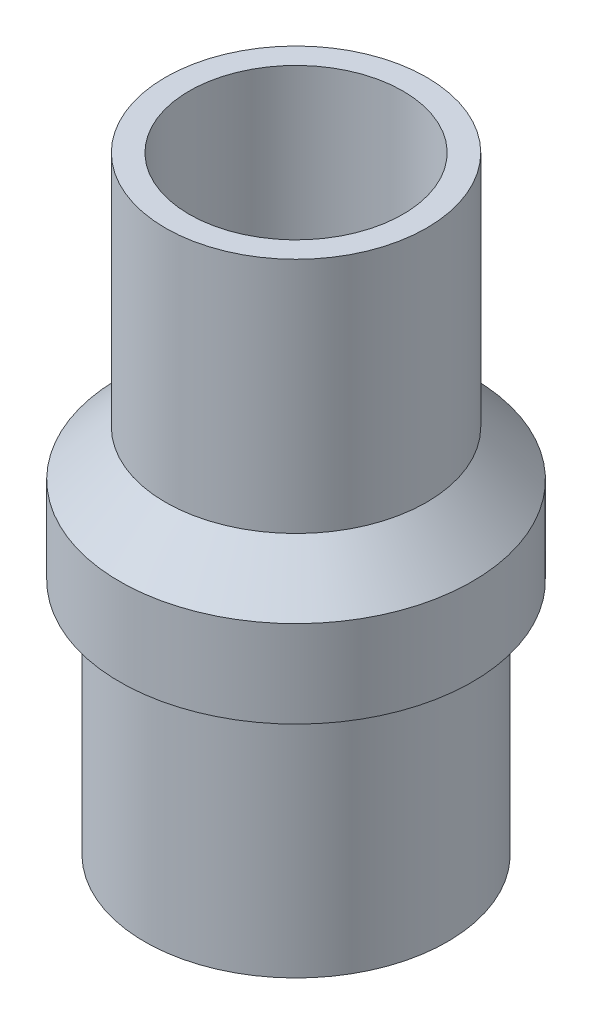
ISO-10303-21;
HEADER;
FILE_DESCRIPTION(('STEP AP214'),'2;1');
FILE_NAME('part.step','',(''),(''),'','','');
FILE_SCHEMA(('AUTOMOTIVE_DESIGN { 1 0 10303 214 1 1 1 1 }'));
ENDSEC;
DATA;
#1=APPLICATION_CONTEXT('core data for automotive mechanical design processes');
#2=APPLICATION_PROTOCOL_DEFINITION('international standard','automotive_design',2000,#1);
#3=PRODUCT_CONTEXT('',#1,'mechanical');
#4=PRODUCT('Part','Part','',(#3));
#5=PRODUCT_RELATED_PRODUCT_CATEGORY('part','',(#4));
#6=PRODUCT_DEFINITION_FORMATION('','',#4);
#7=PRODUCT_DEFINITION_CONTEXT('part definition',#1,'design');
#8=PRODUCT_DEFINITION('design','',#6,#7);
#9=PRODUCT_DEFINITION_SHAPE('','',#8);
#10=(LENGTH_UNIT() NAMED_UNIT(*) SI_UNIT(.MILLI.,.METRE.));
#11=(NAMED_UNIT(*) PLANE_ANGLE_UNIT() SI_UNIT($,.RADIAN.));
#12=(NAMED_UNIT(*) SI_UNIT($,.STERADIAN.) SOLID_ANGLE_UNIT());
#13=UNCERTAINTY_MEASURE_WITH_UNIT(LENGTH_MEASURE(1.E-05),#10,'distance_accuracy_value','');
#14=(GEOMETRIC_REPRESENTATION_CONTEXT(3) GLOBAL_UNCERTAINTY_ASSIGNED_CONTEXT((#13)) GLOBAL_UNIT_ASSIGNED_CONTEXT((#10,
#11,#12)) REPRESENTATION_CONTEXT('',''));
#15=CARTESIAN_POINT('',(0.,0.,0.));
#16=DIRECTION('',(0.,0.,1.));
#17=DIRECTION('',(1.,0.,0.));
#18=AXIS2_PLACEMENT_3D('',#15,#16,#17);
#19=CARTESIAN_POINT('',(0.,0.5,0.));
#20=DIRECTION('',(0.,-1.,0.));
#21=DIRECTION('',(0.,0.,-1.));
#22=AXIS2_PLACEMENT_3D('',#19,#20,#21);
#23=PLANE('',#22);
#24=CARTESIAN_POINT('',(0.,0.5,0.));
#25=DIRECTION('',(0.,-1.,0.));
#26=DIRECTION('',(0.,0.,-1.));
#27=AXIS2_PLACEMENT_3D('',#24,#25,#26);
#28=CIRCLE('',#27,1.25);
#29=CARTESIAN_POINT('',(0.,0.5,-1.25));
#30=VERTEX_POINT('',#29);
#31=EDGE_CURVE('E11',#30,#30,#28,.T.);
#32=ORIENTED_EDGE('',*,*,#31,.F.);
#33=EDGE_LOOP('',(#32));
#34=FACE_BOUND('',#33,.T.);
#35=ADVANCED_FACE('F46',(#34),#23,.F.);
#36=CARTESIAN_POINT('',(0.,0.,0.));
#37=DIRECTION('',(0.,-1.,0.));
#38=DIRECTION('',(0.,0.,-1.));
#39=AXIS2_PLACEMENT_3D('',#36,#37,#38);
#40=CYLINDRICAL_SURFACE('',#39,1.25);
#41=CARTESIAN_POINT('',(0.,-2.2,0.));
#42=DIRECTION('',(0.,-1.,0.));
#43=DIRECTION('',(0.,0.,-1.));
#44=AXIS2_PLACEMENT_3D('',#41,#42,#43);
#45=CIRCLE('',#44,1.25);
#46=CARTESIAN_POINT('',(0.,-2.2,-1.25));
#47=VERTEX_POINT('',#46);
#48=EDGE_CURVE('E52',#47,#47,#45,.T.);
#49=ORIENTED_EDGE('',*,*,#48,.F.);
#50=EDGE_LOOP('',(#49));
#51=FACE_BOUND('',#50,.T.);
#52=ORIENTED_EDGE('',*,*,#31,.T.);
#53=EDGE_LOOP('',(#52));
#54=FACE_BOUND('',#53,.T.);
#55=ADVANCED_FACE('F76',(#51,#54),#40,.T.);
#56=CARTESIAN_POINT('',(-1.25,-2.2,0.));
#57=DIRECTION('',(0.,-1.,0.));
#58=DIRECTION('',(0.,0.,-1.));
#59=AXIS2_PLACEMENT_3D('',#56,#57,#58);
#60=PLANE('',#59);
#61=CARTESIAN_POINT('',(0.,-2.2,0.));
#62=DIRECTION('',(0.,-1.,0.));
#63=DIRECTION('',(0.,0.,-1.));
#64=AXIS2_PLACEMENT_3D('',#61,#62,#63);
#65=CIRCLE('',#64,3.);
#66=CARTESIAN_POINT('',(0.,-2.2,-3.));
#67=VERTEX_POINT('',#66);
#68=EDGE_CURVE('E56',#67,#67,#65,.T.);
#69=ORIENTED_EDGE('',*,*,#68,.F.);
#70=EDGE_LOOP('',(#69));
#71=FACE_BOUND('',#70,.T.);
#72=ORIENTED_EDGE('',*,*,#48,.T.);
#73=EDGE_LOOP('',(#72));
#74=FACE_BOUND('',#73,.T.);
#75=ADVANCED_FACE('F71',(#71,#74),#60,.F.);
#76=CARTESIAN_POINT('',(0.,0.,0.));
#77=DIRECTION('',(0.,-1.,0.));
#78=DIRECTION('',(0.,0.,-1.));
#79=AXIS2_PLACEMENT_3D('',#76,#77,#78);
#80=CYLINDRICAL_SURFACE('',#79,3.);
#81=CARTESIAN_POINT('',(0.,-3.7,0.));
#82=DIRECTION('',(0.,-1.,0.));
#83=DIRECTION('',(0.,0.,-1.));
#84=AXIS2_PLACEMENT_3D('',#81,#82,#83);
#85=CIRCLE('',#84,3.);
#86=CARTESIAN_POINT('',(0.,-3.7,-3.));
#87=VERTEX_POINT('',#86);
#88=EDGE_CURVE('E60',#87,#87,#85,.T.);
#89=ORIENTED_EDGE('',*,*,#88,.F.);
#90=EDGE_LOOP('',(#89));
#91=FACE_BOUND('',#90,.T.);
#92=ORIENTED_EDGE('',*,*,#68,.T.);
#93=EDGE_LOOP('',(#92));
#94=FACE_BOUND('',#93,.T.);
#95=ADVANCED_FACE('F68',(#91,#94),#80,.T.);
#96=CARTESIAN_POINT('',(-3.,-3.7,0.));
#97=DIRECTION('',(0.,1.,0.));
#98=DIRECTION('',(0.,0.,1.));
#99=AXIS2_PLACEMENT_3D('',#96,#97,#98);
#100=PLANE('',#99);
#101=ORIENTED_EDGE('',*,*,#88,.T.);
#102=EDGE_LOOP('',(#101));
#103=FACE_BOUND('',#102,.T.);
#104=ADVANCED_FACE('F66',(#103),#100,.F.);
#105=CLOSED_SHELL('',(#35,#55,#75,#95,#104));
#106=MANIFOLD_SOLID_BREP('B2',#105);
#107=CARTESIAN_POINT('',(12.85,-3.,0.));
#108=DIRECTION('',(0.,-1.,0.));
#109=DIRECTION('',(0.,0.,-1.));
#110=AXIS2_PLACEMENT_3D('',#107,#108,#109);
#111=PLANE('',#110);
#112=CARTESIAN_POINT('',(0.,-3.,0.));
#113=DIRECTION('',(0.,-1.,0.));
#114=DIRECTION('',(0.,0.,-1.));
#115=AXIS2_PLACEMENT_3D('',#112,#113,#114);
#116=CIRCLE('',#115,14.85);
#117=CARTESIAN_POINT('',(0.,-3.,-14.85));
#118=VERTEX_POINT('',#117);
#119=EDGE_CURVE('E159',#118,#118,#116,.T.);
#120=ORIENTED_EDGE('',*,*,#119,.T.);
#121=EDGE_LOOP('',(#120));
#122=FACE_BOUND('',#121,.T.);
#123=CARTESIAN_POINT('',(0.,-3.,0.));
#124=DIRECTION('',(0.,-1.,0.));
#125=DIRECTION('',(0.,0.,-1.));
#126=AXIS2_PLACEMENT_3D('',#123,#124,#125);
#127=CIRCLE('',#126,12.85);
#128=CARTESIAN_POINT('',(0.,-3.,-12.85));
#129=VERTEX_POINT('',#128);
#130=EDGE_CURVE('E45',#129,#129,#127,.T.);
#131=ORIENTED_EDGE('',*,*,#130,.F.);
#132=EDGE_LOOP('',(#131));
#133=FACE_BOUND('',#132,.T.);
#134=ADVANCED_FACE('F131',(#122,#133),#111,.T.);
#135=CARTESIAN_POINT('',(0.,0.,0.));
#136=DIRECTION('',(0.,-1.,0.));
#137=DIRECTION('',(0.,0.,-1.));
#138=AXIS2_PLACEMENT_3D('',#135,#136,#137);
#139=CYLINDRICAL_SURFACE('',#138,12.85);
#140=ORIENTED_EDGE('',*,*,#130,.T.);
#141=EDGE_LOOP('',(#140));
#142=FACE_BOUND('',#141,.T.);
#143=CARTESIAN_POINT('',(0.,3.5,0.));
#144=DIRECTION('',(0.,-1.,0.));
#145=DIRECTION('',(0.,0.,-1.));
#146=AXIS2_PLACEMENT_3D('',#143,#144,#145);
#147=CIRCLE('',#146,12.85);
#148=CARTESIAN_POINT('',(0.,3.5,-12.85));
#149=VERTEX_POINT('',#148);
#150=EDGE_CURVE('E137',#149,#149,#147,.T.);
#151=ORIENTED_EDGE('',*,*,#150,.F.);
#152=EDGE_LOOP('',(#151));
#153=FACE_BOUND('',#152,.T.);
#154=ADVANCED_FACE('F177',(#142,#153),#139,.F.);
#155=CARTESIAN_POINT('',(0.,7.35000000000005,0.));
#156=DIRECTION('',(0.,-1.,0.));
#157=DIRECTION('',(0.,0.,-1.));
#158=AXIS2_PLACEMENT_3D('',#155,#156,#157);
#159=CONICAL_SURFACE('',#158,9.,0.785398163397442);
#160=ORIENTED_EDGE('',*,*,#150,.T.);
#161=EDGE_LOOP('',(#160));
#162=FACE_BOUND('',#161,.T.);
#163=CARTESIAN_POINT('',(0.,7.35000000000005,0.));
#164=DIRECTION('',(0.,-1.,0.));
#165=DIRECTION('',(0.,0.,-1.));
#166=AXIS2_PLACEMENT_3D('',#163,#164,#165);
#167=CIRCLE('',#166,9.);
#168=CARTESIAN_POINT('',(0.,7.35000000000005,-9.));
#169=VERTEX_POINT('',#168);
#170=EDGE_CURVE('E141',#169,#169,#167,.T.);
#171=ORIENTED_EDGE('',*,*,#170,.F.);
#172=EDGE_LOOP('',(#171));
#173=FACE_BOUND('',#172,.T.);
#174=ADVANCED_FACE('F181',(#162,#173),#159,.F.);
#175=CARTESIAN_POINT('',(0.,0.,0.));
#176=DIRECTION('',(0.,-1.,0.));
#177=DIRECTION('',(0.,0.,-1.));
#178=AXIS2_PLACEMENT_3D('',#175,#176,#177);
#179=CYLINDRICAL_SURFACE('',#178,9.);
#180=ORIENTED_EDGE('',*,*,#170,.T.);
#181=EDGE_LOOP('',(#180));
#182=FACE_BOUND('',#181,.T.);
#183=CARTESIAN_POINT('',(0.,28.1784271247462,0.));
#184=DIRECTION('',(0.,-1.,0.));
#185=DIRECTION('',(0.,0.,-1.));
#186=AXIS2_PLACEMENT_3D('',#183,#184,#185);
#187=CIRCLE('',#186,9.);
#188=CARTESIAN_POINT('',(0.,28.1784271247462,-9.));
#189=VERTEX_POINT('',#188);
#190=EDGE_CURVE('E145',#189,#189,#187,.T.);
#191=ORIENTED_EDGE('',*,*,#190,.F.);
#192=EDGE_LOOP('',(#191));
#193=FACE_BOUND('',#192,.T.);
#194=ADVANCED_FACE('F185',(#182,#193),#179,.F.);
#195=CARTESIAN_POINT('',(9.,28.1784271247462,0.));
#196=DIRECTION('',(0.,1.,0.));
#197=DIRECTION('',(0.,0.,1.));
#198=AXIS2_PLACEMENT_3D('',#195,#196,#197);
#199=PLANE('',#198);
#200=ORIENTED_EDGE('',*,*,#190,.T.);
#201=EDGE_LOOP('',(#200));
#202=FACE_BOUND('',#201,.T.);
#203=CARTESIAN_POINT('',(0.,28.1784271247462,0.));
#204=DIRECTION('',(0.,-1.,0.));
#205=DIRECTION('',(0.,0.,-1.));
#206=AXIS2_PLACEMENT_3D('',#203,#204,#205);
#207=CIRCLE('',#206,11.);
#208=CARTESIAN_POINT('',(0.,28.1784271247462,-11.));
#209=VERTEX_POINT('',#208);
#210=EDGE_CURVE('E150',#209,#209,#207,.T.);
#211=ORIENTED_EDGE('',*,*,#210,.F.);
#212=EDGE_LOOP('',(#211));
#213=FACE_BOUND('',#212,.T.);
#214=ADVANCED_FACE('F191',(#202,#213),#199,.T.);
#215=CARTESIAN_POINT('',(0.,0.,0.));
#216=DIRECTION('',(0.,-1.,0.));
#217=DIRECTION('',(0.,0.,-1.));
#218=AXIS2_PLACEMENT_3D('',#215,#216,#217);
#219=CYLINDRICAL_SURFACE('',#218,11.);
#220=ORIENTED_EDGE('',*,*,#210,.T.);
#221=EDGE_LOOP('',(#220));
#222=FACE_BOUND('',#221,.T.);
#223=CARTESIAN_POINT('',(0.,8.17842712474622,0.));
#224=DIRECTION('',(0.,-1.,0.));
#225=DIRECTION('',(0.,0.,-1.));
#226=AXIS2_PLACEMENT_3D('',#223,#224,#225);
#227=CIRCLE('',#226,11.);
#228=CARTESIAN_POINT('',(0.,8.17842712474622,-11.));
#229=VERTEX_POINT('',#228);
#230=EDGE_CURVE('E153',#229,#229,#227,.T.);
#231=ORIENTED_EDGE('',*,*,#230,.F.);
#232=EDGE_LOOP('',(#231));
#233=FACE_BOUND('',#232,.T.);
#234=ADVANCED_FACE('F173',(#222,#233),#219,.T.);
#235=CARTESIAN_POINT('',(0.,4.32842712474619,0.));
#236=DIRECTION('',(0.,-1.,0.));
#237=DIRECTION('',(0.,0.,-1.));
#238=AXIS2_PLACEMENT_3D('',#235,#236,#237);
#239=CONICAL_SURFACE('',#238,14.85,0.785398163397443);
#240=ORIENTED_EDGE('',*,*,#230,.T.);
#241=EDGE_LOOP('',(#240));
#242=FACE_BOUND('',#241,.T.);
#243=CARTESIAN_POINT('',(0.,4.32842712474619,0.));
#244=DIRECTION('',(0.,-1.,0.));
#245=DIRECTION('',(0.,0.,-1.));
#246=AXIS2_PLACEMENT_3D('',#243,#244,#245);
#247=CIRCLE('',#246,14.85);
#248=CARTESIAN_POINT('',(0.,4.32842712474619,-14.85));
#249=VERTEX_POINT('',#248);
#250=EDGE_CURVE('E156',#249,#249,#247,.T.);
#251=ORIENTED_EDGE('',*,*,#250,.F.);
#252=EDGE_LOOP('',(#251));
#253=FACE_BOUND('',#252,.T.);
#254=ADVANCED_FACE('F167',(#242,#253),#239,.T.);
#255=CARTESIAN_POINT('',(0.,0.,0.));
#256=DIRECTION('',(0.,-1.,0.));
#257=DIRECTION('',(0.,0.,-1.));
#258=AXIS2_PLACEMENT_3D('',#255,#256,#257);
#259=CYLINDRICAL_SURFACE('',#258,14.85);
#260=ORIENTED_EDGE('',*,*,#250,.T.);
#261=EDGE_LOOP('',(#260));
#262=FACE_BOUND('',#261,.T.);
#263=ORIENTED_EDGE('',*,*,#119,.F.);
#264=EDGE_LOOP('',(#263));
#265=FACE_BOUND('',#264,.T.);
#266=ADVANCED_FACE('F165',(#262,#265),#259,.T.);
#267=CLOSED_SHELL('',(#134,#154,#174,#194,#214,#234,#254,#266));
#268=MANIFOLD_SOLID_BREP('B6',#267);
#269=CARTESIAN_POINT('',(0.,0.,0.));
#270=DIRECTION('',(0.,-1.,0.));
#271=DIRECTION('',(0.,0.,-1.));
#272=AXIS2_PLACEMENT_3D('',#269,#270,#271);
#273=CYLINDRICAL_SURFACE('',#272,10.75);
#274=CARTESIAN_POINT('',(0.,-23.,0.));
#275=DIRECTION('',(0.,-1.,0.));
#276=DIRECTION('',(0.,0.,-1.));
#277=AXIS2_PLACEMENT_3D('',#274,#275,#276);
#278=CIRCLE('',#277,10.75);
#279=CARTESIAN_POINT('',(0.,-23.,-10.75));
#280=VERTEX_POINT('',#279);
#281=EDGE_CURVE('E445',#280,#280,#278,.T.);
#282=ORIENTED_EDGE('',*,*,#281,.T.);
#283=EDGE_LOOP('',(#282));
#284=FACE_BOUND('',#283,.T.);
#285=CARTESIAN_POINT('',(0.,-2.,0.));
#286=DIRECTION('',(0.,1.,0.));
#287=DIRECTION('',(0.,0.,1.));
#288=AXIS2_PLACEMENT_3D('',#285,#286,#287);
#289=CIRCLE('',#288,10.75);
#290=CARTESIAN_POINT('',(0.,-2.,10.75));
#291=VERTEX_POINT('',#290);
#292=EDGE_CURVE('E384',#291,#291,#289,.T.);
#293=ORIENTED_EDGE('',*,*,#292,.T.);
#294=EDGE_LOOP('',(#293));
#295=FACE_BOUND('',#294,.T.);
#296=ADVANCED_FACE('F261',(#284,#295),#273,.F.);
#297=CARTESIAN_POINT('',(0.,0.,0.));
#298=DIRECTION('',(0.,-1.,0.));
#299=DIRECTION('',(0.,0.,-1.));
#300=AXIS2_PLACEMENT_3D('',#297,#298,#299);
#301=CYLINDRICAL_SURFACE('',#300,13.35);
#302=CARTESIAN_POINT('',(0.,-3.1,0.));
#303=DIRECTION('',(0.,-1.,0.));
#304=DIRECTION('',(0.,0.,-1.));
#305=AXIS2_PLACEMENT_3D('',#302,#303,#304);
#306=CIRCLE('',#305,13.35);
#307=CARTESIAN_POINT('',(0.,-3.1,-13.35));
#308=VERTEX_POINT('',#307);
#309=EDGE_CURVE('E270',#308,#308,#306,.T.);
#310=ORIENTED_EDGE('',*,*,#309,.T.);
#311=EDGE_LOOP('',(#310));
#312=FACE_BOUND('',#311,.T.);
#313=CARTESIAN_POINT('',(0.,-3.8,0.));
#314=DIRECTION('',(0.,-1.,0.));
#315=DIRECTION('',(0.,0.,-1.));
#316=AXIS2_PLACEMENT_3D('',#313,#314,#315);
#317=CIRCLE('',#316,13.35);
#318=CARTESIAN_POINT('',(0.,-3.8,-13.35));
#319=VERTEX_POINT('',#318);
#320=EDGE_CURVE('E454',#319,#319,#317,.T.);
#321=ORIENTED_EDGE('',*,*,#320,.F.);
#322=EDGE_LOOP('',(#321));
#323=FACE_BOUND('',#322,.T.);
#324=ADVANCED_FACE('F459',(#312,#323),#301,.T.);
#325=CARTESIAN_POINT('',(13.35,-3.8,0.));
#326=DIRECTION('',(0.,-1.,0.));
#327=DIRECTION('',(0.,0.,-1.));
#328=AXIS2_PLACEMENT_3D('',#325,#326,#327);
#329=PLANE('',#328);
#330=ORIENTED_EDGE('',*,*,#320,.T.);
#331=EDGE_LOOP('',(#330));
#332=FACE_BOUND('',#331,.T.);
#333=CARTESIAN_POINT('',(0.,-3.8,0.));
#334=DIRECTION('',(0.,-1.,0.));
#335=DIRECTION('',(0.,0.,-1.));
#336=AXIS2_PLACEMENT_3D('',#333,#334,#335);
#337=CIRCLE('',#336,12.75);
#338=CARTESIAN_POINT('',(0.,-3.8,-12.75));
#339=VERTEX_POINT('',#338);
#340=EDGE_CURVE('E451',#339,#339,#337,.T.);
#341=ORIENTED_EDGE('',*,*,#340,.F.);
#342=EDGE_LOOP('',(#341));
#343=FACE_BOUND('',#342,.T.);
#344=ADVANCED_FACE('F477',(#332,#343),#329,.T.);
#345=CARTESIAN_POINT('',(0.,0.,0.));
#346=DIRECTION('',(0.,-1.,0.));
#347=DIRECTION('',(0.,0.,-1.));
#348=AXIS2_PLACEMENT_3D('',#345,#346,#347);
#349=CYLINDRICAL_SURFACE('',#348,12.75);
#350=ORIENTED_EDGE('',*,*,#340,.T.);
#351=EDGE_LOOP('',(#350));
#352=FACE_BOUND('',#351,.T.);
#353=CARTESIAN_POINT('',(0.,-23.,0.));
#354=DIRECTION('',(0.,-1.,0.));
#355=DIRECTION('',(0.,0.,-1.));
#356=AXIS2_PLACEMENT_3D('',#353,#354,#355);
#357=CIRCLE('',#356,12.75);
#358=CARTESIAN_POINT('',(0.,-23.,-12.75));
#359=VERTEX_POINT('',#358);
#360=EDGE_CURVE('E448',#359,#359,#357,.T.);
#361=ORIENTED_EDGE('',*,*,#360,.F.);
#362=EDGE_LOOP('',(#361));
#363=FACE_BOUND('',#362,.T.);
#364=ADVANCED_FACE('F486',(#352,#363),#349,.T.);
#365=CARTESIAN_POINT('',(10.75,-23.,0.));
#366=DIRECTION('',(0.,-1.,0.));
#367=DIRECTION('',(0.,0.,-1.));
#368=AXIS2_PLACEMENT_3D('',#365,#366,#367);
#369=PLANE('',#368);
#370=ORIENTED_EDGE('',*,*,#360,.T.);
#371=EDGE_LOOP('',(#370));
#372=FACE_BOUND('',#371,.T.);
#373=ORIENTED_EDGE('',*,*,#281,.F.);
#374=EDGE_LOOP('',(#373));
#375=FACE_BOUND('',#374,.T.);
#376=ADVANCED_FACE('F483',(#372,#375),#369,.T.);
#377=CARTESIAN_POINT('',(10.75,0.,0.));
#378=DIRECTION('',(0.,1.,0.));
#379=DIRECTION('',(0.,0.,1.));
#380=AXIS2_PLACEMENT_3D('',#377,#378,#379);
#381=PLANE('',#380);
#382=CARTESIAN_POINT('',(0.,0.,0.));
#383=DIRECTION('',(0.,-1.,0.));
#384=DIRECTION('',(0.,0.,-1.));
#385=AXIS2_PLACEMENT_3D('',#382,#383,#384);
#386=CIRCLE('',#385,12.75);
#387=CARTESIAN_POINT('',(0.,0.,-12.75));
#388=VERTEX_POINT('',#387);
#389=EDGE_CURVE('E423',#388,#388,#386,.T.);
#390=ORIENTED_EDGE('',*,*,#389,.F.);
#391=EDGE_LOOP('',(#390));
#392=FACE_BOUND('',#391,.T.);
#393=DIRECTION('',(0.,0.,1.));
#394=VECTOR('',#393,1.);
#395=CARTESIAN_POINT('',(-1.5,0.,0.));
#396=LINE('',#395,#394);
#397=CARTESIAN_POINT('',(-1.5,0.,-8.87411967464942));
#398=VERTEX_POINT('',#397);
#399=CARTESIAN_POINT('',(-1.5,0.,-2.59807621135332));
#400=VERTEX_POINT('',#399);
#401=EDGE_CURVE('E387',#398,#400,#396,.T.);
#402=ORIENTED_EDGE('',*,*,#401,.T.);
#403=CARTESIAN_POINT('',(0.,0.,0.));
#404=DIRECTION('',(0.,1.,0.));
#405=DIRECTION('',(0.,0.,1.));
#406=AXIS2_PLACEMENT_3D('',#403,#404,#405);
#407=CIRCLE('',#406,3.);
#408=CARTESIAN_POINT('',(-3.,0.,0.));
#409=VERTEX_POINT('',#408);
#410=EDGE_CURVE('E390',#400,#409,#407,.T.);
#411=ORIENTED_EDGE('',*,*,#410,.T.);
#412=DIRECTION('',(0.866025403784438,0.,-0.500000000000001));
#413=VECTOR('',#412,1.);
#414=CARTESIAN_POINT('',(-0.750000000000001,0.,-1.29903810567666));
#415=LINE('',#414,#413);
#416=CARTESIAN_POINT('',(-8.4352130744697,0.,3.13802173164806));
#417=VERTEX_POINT('',#416);
#418=EDGE_CURVE('E393',#417,#409,#415,.T.);
#419=ORIENTED_EDGE('',*,*,#418,.F.);
#420=CARTESIAN_POINT('',(0.,0.,0.));
#421=DIRECTION('',(0.,1.,0.));
#422=DIRECTION('',(0.,0.,1.));
#423=AXIS2_PLACEMENT_3D('',#420,#421,#422);
#424=CIRCLE('',#423,9.);
#425=EDGE_CURVE('E396',#398,#417,#424,.T.);
#426=ORIENTED_EDGE('',*,*,#425,.F.);
#427=EDGE_LOOP('',(#402,#411,#419,#426));
#428=FACE_BOUND('',#427,.T.);
#429=CARTESIAN_POINT('',(0.,0.,0.));
#430=DIRECTION('',(0.,1.,0.));
#431=DIRECTION('',(0.,0.,1.));
#432=AXIS2_PLACEMENT_3D('',#429,#430,#431);
#433=CIRCLE('',#432,1.25);
#434=CARTESIAN_POINT('',(0.,0.,1.25));
#435=VERTEX_POINT('',#434);
#436=EDGE_CURVE('E398',#435,#435,#433,.T.);
#437=ORIENTED_EDGE('',*,*,#436,.F.);
#438=EDGE_LOOP('',(#437));
#439=FACE_BOUND('',#438,.T.);
#440=CARTESIAN_POINT('',(0.,0.,0.));
#441=DIRECTION('',(0.,1.,0.));
#442=DIRECTION('',(0.,0.,1.));
#443=AXIS2_PLACEMENT_3D('',#440,#441,#442);
#444=CIRCLE('',#443,9.);
#445=CARTESIAN_POINT('',(-6.93521307446969,0.,5.73609794300137));
#446=VERTEX_POINT('',#445);
#447=CARTESIAN_POINT('',(6.9352130744697,0.,5.73609794300137));
#448=VERTEX_POINT('',#447);
#449=EDGE_CURVE('E401',#446,#448,#444,.T.);
#450=ORIENTED_EDGE('',*,*,#449,.F.);
#451=DIRECTION('',(0.866025403784438,0.,-0.5));
#452=VECTOR('',#451,1.);
#453=CARTESIAN_POINT('',(0.750000000000001,0.,1.29903810567666));
#454=LINE('',#453,#452);
#455=CARTESIAN_POINT('',(-1.5,0.,2.59807621135332));
#456=VERTEX_POINT('',#455);
#457=EDGE_CURVE('E404',#446,#456,#454,.T.);
#458=ORIENTED_EDGE('',*,*,#457,.T.);
#459=CARTESIAN_POINT('',(0.,0.,0.));
#460=DIRECTION('',(0.,1.,0.));
#461=DIRECTION('',(0.,0.,1.));
#462=AXIS2_PLACEMENT_3D('',#459,#460,#461);
#463=CIRCLE('',#462,3.);
#464=CARTESIAN_POINT('',(1.5,0.,2.59807621135332));
#465=VERTEX_POINT('',#464);
#466=EDGE_CURVE('E407',#456,#465,#463,.T.);
#467=ORIENTED_EDGE('',*,*,#466,.T.);
#468=DIRECTION('',(-0.866025403784439,0.,-0.5));
#469=VECTOR('',#468,1.);
#470=CARTESIAN_POINT('',(-0.75,0.,1.29903810567666));
#471=LINE('',#470,#469);
#472=EDGE_CURVE('E410',#448,#465,#471,.T.);
#473=ORIENTED_EDGE('',*,*,#472,.F.);
#474=EDGE_LOOP('',(#450,#458,#467,#473));
#475=FACE_BOUND('',#474,.T.);
#476=CARTESIAN_POINT('',(0.,0.,0.));
#477=DIRECTION('',(0.,1.,0.));
#478=DIRECTION('',(0.,0.,1.));
#479=AXIS2_PLACEMENT_3D('',#476,#477,#478);
#480=CIRCLE('',#479,9.);
#481=CARTESIAN_POINT('',(8.4352130744697,0.,3.13802173164805));
#482=VERTEX_POINT('',#481);
#483=CARTESIAN_POINT('',(1.5,0.,-8.87411967464942));
#484=VERTEX_POINT('',#483);
#485=EDGE_CURVE('E413',#482,#484,#480,.T.);
#486=ORIENTED_EDGE('',*,*,#485,.F.);
#487=DIRECTION('',(-0.866025403784439,0.,-0.5));
#488=VECTOR('',#487,1.);
#489=CARTESIAN_POINT('',(0.75,0.,-1.29903810567666));
#490=LINE('',#489,#488);
#491=CARTESIAN_POINT('',(3.,0.,0.));
#492=VERTEX_POINT('',#491);
#493=EDGE_CURVE('E416',#482,#492,#490,.T.);
#494=ORIENTED_EDGE('',*,*,#493,.T.);
#495=CARTESIAN_POINT('',(0.,0.,0.));
#496=DIRECTION('',(0.,1.,0.));
#497=DIRECTION('',(0.,0.,1.));
#498=AXIS2_PLACEMENT_3D('',#495,#496,#497);
#499=CIRCLE('',#498,3.);
#500=CARTESIAN_POINT('',(1.5,0.,-2.59807621135332));
#501=VERTEX_POINT('',#500);
#502=EDGE_CURVE('E362',#492,#501,#499,.T.);
#503=ORIENTED_EDGE('',*,*,#502,.T.);
#504=DIRECTION('',(0.,0.,1.));
#505=VECTOR('',#504,1.);
#506=CARTESIAN_POINT('',(1.5,0.,0.));
#507=LINE('',#506,#505);
#508=EDGE_CURVE('E325',#484,#501,#507,.T.);
#509=ORIENTED_EDGE('',*,*,#508,.F.);
#510=EDGE_LOOP('',(#486,#494,#503,#509));
#511=FACE_BOUND('',#510,.T.);
#512=ADVANCED_FACE('F481',(#392,#428,#439,#475,#511),#381,.T.);
#513=CARTESIAN_POINT('',(0.,0.,0.));
#514=DIRECTION('',(0.,-1.,0.));
#515=DIRECTION('',(0.,0.,-1.));
#516=AXIS2_PLACEMENT_3D('',#513,#514,#515);
#517=CYLINDRICAL_SURFACE('',#516,12.75);
#518=CARTESIAN_POINT('',(0.,-2.5,0.));
#519=DIRECTION('',(0.,1.,0.));
#520=DIRECTION('',(0.,0.,1.));
#521=AXIS2_PLACEMENT_3D('',#518,#519,#520);
#522=CIRCLE('',#521,12.75);
#523=CARTESIAN_POINT('',(0.,-2.5,12.75));
#524=VERTEX_POINT('',#523);
#525=EDGE_CURVE('E129',#524,#524,#522,.T.);
#526=ORIENTED_EDGE('',*,*,#525,.T.);
#527=EDGE_LOOP('',(#526));
#528=FACE_BOUND('',#527,.T.);
#529=ORIENTED_EDGE('',*,*,#389,.T.);
#530=EDGE_LOOP('',(#529));
#531=FACE_BOUND('',#530,.T.);
#532=ADVANCED_FACE('F515',(#528,#531),#517,.T.);
#533=CARTESIAN_POINT('',(0.,-2.,0.));
#534=DIRECTION('',(0.,1.,0.));
#535=DIRECTION('',(0.,0.,1.));
#536=AXIS2_PLACEMENT_3D('',#533,#534,#535);
#537=CYLINDRICAL_SURFACE('',#536,9.);
#538=ORIENTED_EDGE('',*,*,#485,.T.);
#539=DIRECTION('',(0.,1.,0.));
#540=VECTOR('',#539,1.);
#541=CARTESIAN_POINT('',(1.5,-2.,-8.87411967464942));
#542=LINE('',#541,#540);
#543=CARTESIAN_POINT('',(1.5,-2.,-8.87411967464942));
#544=VERTEX_POINT('',#543);
#545=EDGE_CURVE('E421',#544,#484,#542,.T.);
#546=ORIENTED_EDGE('',*,*,#545,.F.);
#547=CARTESIAN_POINT('',(0.,-2.,0.));
#548=DIRECTION('',(0.,1.,0.));
#549=DIRECTION('',(0.,0.,1.));
#550=AXIS2_PLACEMENT_3D('',#547,#548,#549);
#551=CIRCLE('',#550,9.);
#552=CARTESIAN_POINT('',(8.4352130744697,-2.,3.13802173164805));
#553=VERTEX_POINT('',#552);
#554=EDGE_CURVE('E377',#553,#544,#551,.T.);
#555=ORIENTED_EDGE('',*,*,#554,.F.);
#556=DIRECTION('',(0.,1.,0.));
#557=VECTOR('',#556,1.);
#558=CARTESIAN_POINT('',(8.4352130744697,-2.,3.13802173164805));
#559=LINE('',#558,#557);
#560=EDGE_CURVE('E367',#553,#482,#559,.T.);
#561=ORIENTED_EDGE('',*,*,#560,.T.);
#562=EDGE_LOOP('',(#538,#546,#555,#561));
#563=FACE_BOUND('',#562,.T.);
#564=ADVANCED_FACE('F521',(#563),#537,.F.);
#565=CARTESIAN_POINT('',(1.5,-2.,0.));
#566=DIRECTION('',(-1.,0.,0.));
#567=DIRECTION('',(0.,0.,1.));
#568=AXIS2_PLACEMENT_3D('',#565,#566,#567);
#569=PLANE('',#568);
#570=ORIENTED_EDGE('',*,*,#508,.T.);
#571=DIRECTION('',(0.,1.,0.));
#572=VECTOR('',#571,1.);
#573=CARTESIAN_POINT('',(1.5,-2.,-2.59807621135332));
#574=LINE('',#573,#572);
#575=CARTESIAN_POINT('',(1.5,-2.,-2.59807621135332));
#576=VERTEX_POINT('',#575);
#577=EDGE_CURVE('E318',#576,#501,#574,.T.);
#578=ORIENTED_EDGE('',*,*,#577,.F.);
#579=DIRECTION('',(0.,0.,1.));
#580=VECTOR('',#579,1.);
#581=CARTESIAN_POINT('',(1.5,-2.,0.));
#582=LINE('',#581,#580);
#583=EDGE_CURVE('E278',#544,#576,#582,.T.);
#584=ORIENTED_EDGE('',*,*,#583,.F.);
#585=ORIENTED_EDGE('',*,*,#545,.T.);
#586=EDGE_LOOP('',(#570,#578,#584,#585));
#587=FACE_BOUND('',#586,.T.);
#588=ADVANCED_FACE('F527',(#587),#569,.F.);
#589=CARTESIAN_POINT('',(0.,-2.,0.));
#590=DIRECTION('',(0.,1.,0.));
#591=DIRECTION('',(0.,0.,1.));
#592=AXIS2_PLACEMENT_3D('',#589,#590,#591);
#593=CYLINDRICAL_SURFACE('',#592,3.);
#594=ORIENTED_EDGE('',*,*,#502,.F.);
#595=DIRECTION('',(0.,1.,0.));
#596=VECTOR('',#595,1.);
#597=CARTESIAN_POINT('',(3.,-2.,0.));
#598=LINE('',#597,#596);
#599=CARTESIAN_POINT('',(3.,-2.,0.));
#600=VERTEX_POINT('',#599);
#601=EDGE_CURVE('E358',#600,#492,#598,.T.);
#602=ORIENTED_EDGE('',*,*,#601,.F.);
#603=CARTESIAN_POINT('',(0.,-2.,0.));
#604=DIRECTION('',(0.,1.,0.));
#605=DIRECTION('',(0.,0.,1.));
#606=AXIS2_PLACEMENT_3D('',#603,#604,#605);
#607=CIRCLE('',#606,3.);
#608=EDGE_CURVE('E361',#600,#576,#607,.T.);
#609=ORIENTED_EDGE('',*,*,#608,.T.);
#610=ORIENTED_EDGE('',*,*,#577,.T.);
#611=EDGE_LOOP('',(#594,#602,#609,#610));
#612=FACE_BOUND('',#611,.T.);
#613=ADVANCED_FACE('F360',(#612),#593,.T.);
#614=CARTESIAN_POINT('',(0.,-2.,0.));
#615=DIRECTION('',(0.,1.,0.));
#616=DIRECTION('',(0.,0.,1.));
#617=AXIS2_PLACEMENT_3D('',#614,#615,#616);
#618=CYLINDRICAL_SURFACE('',#617,9.);
#619=ORIENTED_EDGE('',*,*,#449,.T.);
#620=DIRECTION('',(0.,1.,0.));
#621=VECTOR('',#620,1.);
#622=CARTESIAN_POINT('',(6.9352130744697,-2.,5.73609794300137));
#623=LINE('',#622,#621);
#624=CARTESIAN_POINT('',(6.9352130744697,-2.,5.73609794300137));
#625=VERTEX_POINT('',#624);
#626=EDGE_CURVE('E426',#625,#448,#623,.T.);
#627=ORIENTED_EDGE('',*,*,#626,.F.);
#628=CARTESIAN_POINT('',(0.,-2.,0.));
#629=DIRECTION('',(0.,1.,0.));
#630=DIRECTION('',(0.,0.,1.));
#631=AXIS2_PLACEMENT_3D('',#628,#629,#630);
#632=CIRCLE('',#631,9.);
#633=CARTESIAN_POINT('',(-6.93521307446969,-2.,5.73609794300137));
#634=VERTEX_POINT('',#633);
#635=EDGE_CURVE('E726',#634,#625,#632,.T.);
#636=ORIENTED_EDGE('',*,*,#635,.F.);
#637=DIRECTION('',(0.,1.,0.));
#638=VECTOR('',#637,1.);
#639=CARTESIAN_POINT('',(-6.93521307446969,-2.,5.73609794300137));
#640=LINE('',#639,#638);
#641=EDGE_CURVE('E433',#634,#446,#640,.T.);
#642=ORIENTED_EDGE('',*,*,#641,.T.);
#643=EDGE_LOOP('',(#619,#627,#636,#642));
#644=FACE_BOUND('',#643,.T.);
#645=ADVANCED_FACE('F539',(#644),#618,.F.);
#646=CARTESIAN_POINT('',(-0.75,-2.,1.29903810567666));
#647=DIRECTION('',(0.5,0.,-0.866025403784439));
#648=DIRECTION('',(-0.866025403784439,0.,-0.5));
#649=AXIS2_PLACEMENT_3D('',#646,#647,#648);
#650=PLANE('',#649);
#651=ORIENTED_EDGE('',*,*,#472,.T.);
#652=DIRECTION('',(0.,1.,0.));
#653=VECTOR('',#652,1.);
#654=CARTESIAN_POINT('',(1.5,-2.,2.59807621135332));
#655=LINE('',#654,#653);
#656=CARTESIAN_POINT('',(1.5,-2.,2.59807621135332));
#657=VERTEX_POINT('',#656);
#658=EDGE_CURVE('E429',#657,#465,#655,.T.);
#659=ORIENTED_EDGE('',*,*,#658,.F.);
#660=DIRECTION('',(-0.866025403784439,0.,-0.5));
#661=VECTOR('',#660,1.);
#662=CARTESIAN_POINT('',(-0.75,-2.,1.29903810567666));
#663=LINE('',#662,#661);
#664=EDGE_CURVE('E379',#625,#657,#663,.T.);
#665=ORIENTED_EDGE('',*,*,#664,.F.);
#666=ORIENTED_EDGE('',*,*,#626,.T.);
#667=EDGE_LOOP('',(#651,#659,#665,#666));
#668=FACE_BOUND('',#667,.T.);
#669=ADVANCED_FACE('F545',(#668),#650,.F.);
#670=CARTESIAN_POINT('',(0.,-2.,0.));
#671=DIRECTION('',(0.,1.,0.));
#672=DIRECTION('',(0.,0.,1.));
#673=AXIS2_PLACEMENT_3D('',#670,#671,#672);
#674=CYLINDRICAL_SURFACE('',#673,3.);
#675=ORIENTED_EDGE('',*,*,#466,.F.);
#676=DIRECTION('',(0.,1.,0.));
#677=VECTOR('',#676,1.);
#678=CARTESIAN_POINT('',(-1.5,-2.,2.59807621135332));
#679=LINE('',#678,#677);
#680=CARTESIAN_POINT('',(-1.5,-2.,2.59807621135332));
#681=VERTEX_POINT('',#680);
#682=EDGE_CURVE('E431',#681,#456,#679,.T.);
#683=ORIENTED_EDGE('',*,*,#682,.F.);
#684=CARTESIAN_POINT('',(0.,-2.,0.));
#685=DIRECTION('',(0.,1.,0.));
#686=DIRECTION('',(0.,0.,1.));
#687=AXIS2_PLACEMENT_3D('',#684,#685,#686);
#688=CIRCLE('',#687,3.);
#689=EDGE_CURVE('E732',#681,#657,#688,.T.);
#690=ORIENTED_EDGE('',*,*,#689,.T.);
#691=ORIENTED_EDGE('',*,*,#658,.T.);
#692=EDGE_LOOP('',(#675,#683,#690,#691));
#693=FACE_BOUND('',#692,.T.);
#694=ADVANCED_FACE('F552',(#693),#674,.T.);
#695=CARTESIAN_POINT('',(-1.5,-2.,0.));
#696=DIRECTION('',(-1.,0.,0.));
#697=DIRECTION('',(0.,0.,1.));
#698=AXIS2_PLACEMENT_3D('',#695,#696,#697);
#699=PLANE('',#698);
#700=ORIENTED_EDGE('',*,*,#401,.F.);
#701=DIRECTION('',(0.,1.,0.));
#702=VECTOR('',#701,1.);
#703=CARTESIAN_POINT('',(-1.5,-2.,-8.87411967464942));
#704=LINE('',#703,#702);
#705=CARTESIAN_POINT('',(-1.5,-2.,-8.87411967464942));
#706=VERTEX_POINT('',#705);
#707=EDGE_CURVE('E435',#706,#398,#704,.T.);
#708=ORIENTED_EDGE('',*,*,#707,.F.);
#709=DIRECTION('',(0.,0.,1.));
#710=VECTOR('',#709,1.);
#711=CARTESIAN_POINT('',(-1.5,-2.,0.));
#712=LINE('',#711,#710);
#713=CARTESIAN_POINT('',(-1.5,-2.,-2.59807621135332));
#714=VERTEX_POINT('',#713);
#715=EDGE_CURVE('E420',#706,#714,#712,.T.);
#716=ORIENTED_EDGE('',*,*,#715,.T.);
#717=DIRECTION('',(0.,1.,0.));
#718=VECTOR('',#717,1.);
#719=CARTESIAN_POINT('',(-1.5,-2.,-2.59807621135332));
#720=LINE('',#719,#718);
#721=EDGE_CURVE('E332',#714,#400,#720,.T.);
#722=ORIENTED_EDGE('',*,*,#721,.T.);
#723=EDGE_LOOP('',(#700,#708,#716,#722));
#724=FACE_BOUND('',#723,.T.);
#725=ADVANCED_FACE('F559',(#724),#699,.T.);
#726=CARTESIAN_POINT('',(0.,-2.,0.));
#727=DIRECTION('',(0.,1.,0.));
#728=DIRECTION('',(0.,0.,1.));
#729=AXIS2_PLACEMENT_3D('',#726,#727,#728);
#730=CYLINDRICAL_SURFACE('',#729,9.);
#731=ORIENTED_EDGE('',*,*,#425,.T.);
#732=DIRECTION('',(0.,1.,0.));
#733=VECTOR('',#732,1.);
#734=CARTESIAN_POINT('',(-8.4352130744697,-2.,3.13802173164806));
#735=LINE('',#734,#733);
#736=CARTESIAN_POINT('',(-8.4352130744697,-2.,3.13802173164806));
#737=VERTEX_POINT('',#736);
#738=EDGE_CURVE('E437',#737,#417,#735,.T.);
#739=ORIENTED_EDGE('',*,*,#738,.F.);
#740=CARTESIAN_POINT('',(0.,-2.,0.));
#741=DIRECTION('',(0.,1.,0.));
#742=DIRECTION('',(0.,0.,1.));
#743=AXIS2_PLACEMENT_3D('',#740,#741,#742);
#744=CIRCLE('',#743,9.);
#745=EDGE_CURVE('E721',#706,#737,#744,.T.);
#746=ORIENTED_EDGE('',*,*,#745,.F.);
#747=ORIENTED_EDGE('',*,*,#707,.T.);
#748=EDGE_LOOP('',(#731,#739,#746,#747));
#749=FACE_BOUND('',#748,.T.);
#750=ADVANCED_FACE('F566',(#749),#730,.F.);
#751=CARTESIAN_POINT('',(-0.750000000000001,-2.,-1.29903810567666));
#752=DIRECTION('',(0.500000000000001,0.,0.866025403784438));
#753=DIRECTION('',(0.866025403784438,0.,-0.500000000000001));
#754=AXIS2_PLACEMENT_3D('',#751,#752,#753);
#755=PLANE('',#754);
#756=ORIENTED_EDGE('',*,*,#418,.T.);
#757=DIRECTION('',(0.,1.,0.));
#758=VECTOR('',#757,1.);
#759=CARTESIAN_POINT('',(-3.,-2.,0.));
#760=LINE('',#759,#758);
#761=CARTESIAN_POINT('',(-3.,-2.,0.));
#762=VERTEX_POINT('',#761);
#763=EDGE_CURVE('E440',#762,#409,#760,.T.);
#764=ORIENTED_EDGE('',*,*,#763,.F.);
#765=DIRECTION('',(0.866025403784438,0.,-0.500000000000001));
#766=VECTOR('',#765,1.);
#767=CARTESIAN_POINT('',(-0.750000000000001,-2.,-1.29903810567666));
#768=LINE('',#767,#766);
#769=EDGE_CURVE('E717',#737,#762,#768,.T.);
#770=ORIENTED_EDGE('',*,*,#769,.F.);
#771=ORIENTED_EDGE('',*,*,#738,.T.);
#772=EDGE_LOOP('',(#756,#764,#770,#771));
#773=FACE_BOUND('',#772,.T.);
#774=ADVANCED_FACE('F573',(#773),#755,.F.);
#775=CARTESIAN_POINT('',(0.75,-2.,-1.29903810567666));
#776=DIRECTION('',(0.5,0.,-0.866025403784439));
#777=DIRECTION('',(-0.866025403784439,0.,-0.5));
#778=AXIS2_PLACEMENT_3D('',#775,#776,#777);
#779=PLANE('',#778);
#780=ORIENTED_EDGE('',*,*,#493,.F.);
#781=ORIENTED_EDGE('',*,*,#560,.F.);
#782=DIRECTION('',(-0.866025403784439,0.,-0.5));
#783=VECTOR('',#782,1.);
#784=CARTESIAN_POINT('',(0.75,-2.,-1.29903810567666));
#785=LINE('',#784,#783);
#786=EDGE_CURVE('E373',#553,#600,#785,.T.);
#787=ORIENTED_EDGE('',*,*,#786,.T.);
#788=ORIENTED_EDGE('',*,*,#601,.T.);
#789=EDGE_LOOP('',(#780,#781,#787,#788));
#790=FACE_BOUND('',#789,.T.);
#791=ADVANCED_FACE('F375',(#790),#779,.T.);
#792=CARTESIAN_POINT('',(0.750000000000001,-2.,1.29903810567666));
#793=DIRECTION('',(0.5,0.,0.866025403784438));
#794=DIRECTION('',(0.866025403784438,0.,-0.5));
#795=AXIS2_PLACEMENT_3D('',#792,#793,#794);
#796=PLANE('',#795);
#797=ORIENTED_EDGE('',*,*,#457,.F.);
#798=ORIENTED_EDGE('',*,*,#641,.F.);
#799=DIRECTION('',(0.866025403784438,0.,-0.5));
#800=VECTOR('',#799,1.);
#801=CARTESIAN_POINT('',(0.750000000000001,-2.,1.29903810567666));
#802=LINE('',#801,#800);
#803=EDGE_CURVE('E729',#634,#681,#802,.T.);
#804=ORIENTED_EDGE('',*,*,#803,.T.);
#805=ORIENTED_EDGE('',*,*,#682,.T.);
#806=EDGE_LOOP('',(#797,#798,#804,#805));
#807=FACE_BOUND('',#806,.T.);
#808=ADVANCED_FACE('F586',(#807),#796,.T.);
#809=CARTESIAN_POINT('',(0.,-2.,0.));
#810=DIRECTION('',(0.,1.,0.));
#811=DIRECTION('',(0.,0.,1.));
#812=AXIS2_PLACEMENT_3D('',#809,#810,#811);
#813=CYLINDRICAL_SURFACE('',#812,1.25);
#814=CARTESIAN_POINT('',(0.,-2.,0.));
#815=DIRECTION('',(0.,1.,0.));
#816=DIRECTION('',(0.,0.,1.));
#817=AXIS2_PLACEMENT_3D('',#814,#815,#816);
#818=CIRCLE('',#817,1.25);
#819=CARTESIAN_POINT('',(0.,-2.,1.25));
#820=VERTEX_POINT('',#819);
#821=EDGE_CURVE('E723',#820,#820,#818,.T.);
#822=ORIENTED_EDGE('',*,*,#821,.F.);
#823=EDGE_LOOP('',(#822));
#824=FACE_BOUND('',#823,.T.);
#825=ORIENTED_EDGE('',*,*,#436,.T.);
#826=EDGE_LOOP('',(#825));
#827=FACE_BOUND('',#826,.T.);
#828=ADVANCED_FACE('F592',(#824,#827),#813,.F.);
#829=CARTESIAN_POINT('',(0.,-2.,0.));
#830=DIRECTION('',(0.,1.,0.));
#831=DIRECTION('',(0.,0.,1.));
#832=AXIS2_PLACEMENT_3D('',#829,#830,#831);
#833=CYLINDRICAL_SURFACE('',#832,3.);
#834=ORIENTED_EDGE('',*,*,#410,.F.);
#835=ORIENTED_EDGE('',*,*,#721,.F.);
#836=CARTESIAN_POINT('',(0.,-2.,0.));
#837=DIRECTION('',(0.,1.,0.));
#838=DIRECTION('',(0.,0.,1.));
#839=AXIS2_PLACEMENT_3D('',#836,#837,#838);
#840=CIRCLE('',#839,3.);
#841=EDGE_CURVE('E715',#714,#762,#840,.T.);
#842=ORIENTED_EDGE('',*,*,#841,.T.);
#843=ORIENTED_EDGE('',*,*,#763,.T.);
#844=EDGE_LOOP('',(#834,#835,#842,#843));
#845=FACE_BOUND('',#844,.T.);
#846=ADVANCED_FACE('F467',(#845),#833,.T.);
#847=CARTESIAN_POINT('',(0.,-2.,0.));
#848=DIRECTION('',(0.,1.,0.));
#849=DIRECTION('',(0.,0.,1.));
#850=AXIS2_PLACEMENT_3D('',#847,#848,#849);
#851=PLANE('',#850);
#852=ORIENTED_EDGE('',*,*,#715,.F.);
#853=ORIENTED_EDGE('',*,*,#745,.T.);
#854=ORIENTED_EDGE('',*,*,#769,.T.);
#855=ORIENTED_EDGE('',*,*,#841,.F.);
#856=EDGE_LOOP('',(#852,#853,#854,#855));
#857=FACE_BOUND('',#856,.T.);
#858=ORIENTED_EDGE('',*,*,#821,.T.);
#859=EDGE_LOOP('',(#858));
#860=FACE_BOUND('',#859,.T.);
#861=ORIENTED_EDGE('',*,*,#635,.T.);
#862=ORIENTED_EDGE('',*,*,#664,.T.);
#863=ORIENTED_EDGE('',*,*,#689,.F.);
#864=ORIENTED_EDGE('',*,*,#803,.F.);
#865=EDGE_LOOP('',(#861,#862,#863,#864));
#866=FACE_BOUND('',#865,.T.);
#867=ORIENTED_EDGE('',*,*,#554,.T.);
#868=ORIENTED_EDGE('',*,*,#583,.T.);
#869=ORIENTED_EDGE('',*,*,#608,.F.);
#870=ORIENTED_EDGE('',*,*,#786,.F.);
#871=EDGE_LOOP('',(#867,#868,#869,#870));
#872=FACE_BOUND('',#871,.T.);
#873=ORIENTED_EDGE('',*,*,#292,.F.);
#874=EDGE_LOOP('',(#873));
#875=FACE_BOUND('',#874,.T.);
#876=ADVANCED_FACE('F371',(#857,#860,#866,#872,#875),#851,.F.);
#877=CARTESIAN_POINT('',(0.,-2.5,0.));
#878=DIRECTION('',(0.,1.,0.));
#879=DIRECTION('',(0.,0.,1.));
#880=AXIS2_PLACEMENT_3D('',#877,#878,#879);
#881=TOROIDAL_SURFACE('',#880,13.35,0.6);
#882=ORIENTED_EDGE('',*,*,#525,.F.);
#883=EDGE_LOOP('',(#882));
#884=FACE_BOUND('',#883,.T.);
#885=ORIENTED_EDGE('',*,*,#309,.F.);
#886=EDGE_LOOP('',(#885));
#887=FACE_BOUND('',#886,.T.);
#888=ADVANCED_FACE('F263',(#884,#887),#881,.F.);
#889=CLOSED_SHELL('',(#296,#324,#344,#364,#376,#512,#532,#564,#588,#613,#645,#669,#694,#725,
#750,#774,#791,#808,#828,#846,#876,#888));
#890=MANIFOLD_SOLID_BREP('B40',#889);
#891=ADVANCED_BREP_SHAPE_REPRESENTATION('',(#18,#106,#268,#890),#14);
#892=SHAPE_DEFINITION_REPRESENTATION(#9,#891);
ENDSEC;
END-ISO-10303-21;
